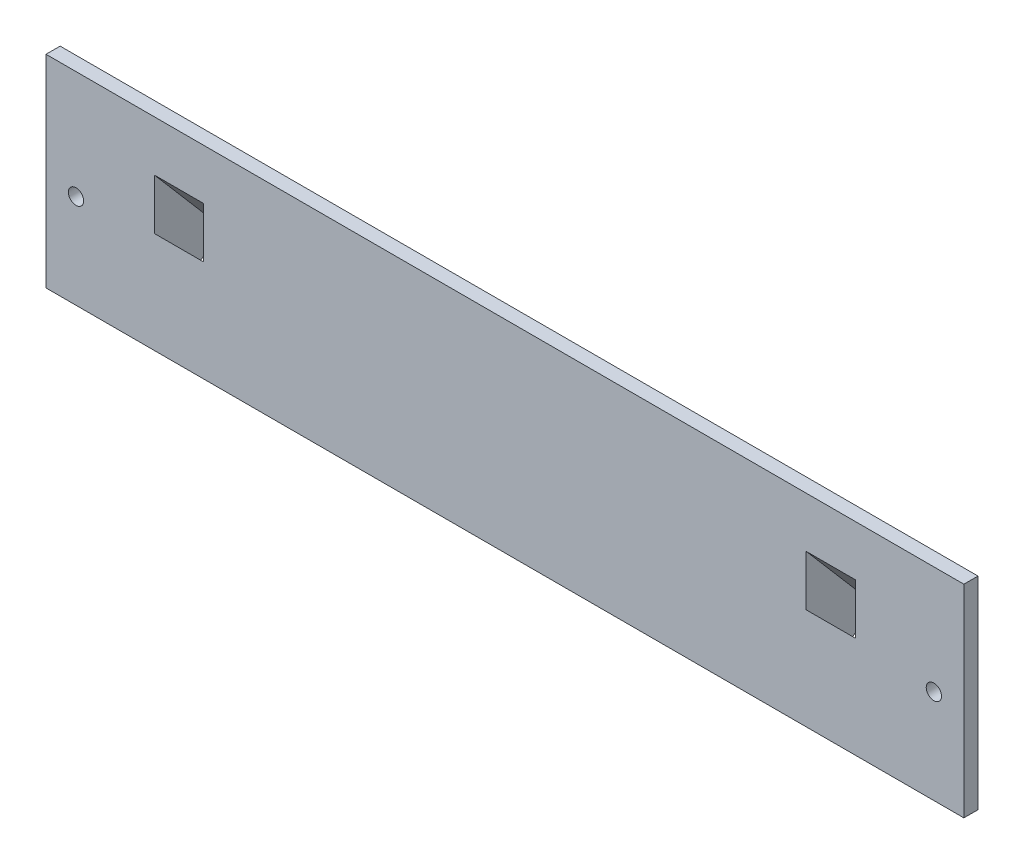
ISO-10303-21;
HEADER;
FILE_DESCRIPTION(('STEP AP214'),'2;1');
FILE_NAME('part.step','',(''),(''),'','','');
FILE_SCHEMA(('AUTOMOTIVE_DESIGN { 1 0 10303 214 1 1 1 1 }'));
ENDSEC;
DATA;
#1=APPLICATION_CONTEXT('core data for automotive mechanical design processes');
#2=APPLICATION_PROTOCOL_DEFINITION('international standard','automotive_design',2000,#1);
#3=PRODUCT_CONTEXT('',#1,'mechanical');
#4=PRODUCT('Part','Part','',(#3));
#5=PRODUCT_RELATED_PRODUCT_CATEGORY('part','',(#4));
#6=PRODUCT_DEFINITION_FORMATION('','',#4);
#7=PRODUCT_DEFINITION_CONTEXT('part definition',#1,'design');
#8=PRODUCT_DEFINITION('design','',#6,#7);
#9=PRODUCT_DEFINITION_SHAPE('','',#8);
#10=(LENGTH_UNIT() NAMED_UNIT(*) SI_UNIT(.MILLI.,.METRE.));
#11=(NAMED_UNIT(*) PLANE_ANGLE_UNIT() SI_UNIT($,.RADIAN.));
#12=(NAMED_UNIT(*) SI_UNIT($,.STERADIAN.) SOLID_ANGLE_UNIT());
#13=UNCERTAINTY_MEASURE_WITH_UNIT(LENGTH_MEASURE(1.E-05),#10,'distance_accuracy_value','');
#14=(GEOMETRIC_REPRESENTATION_CONTEXT(3) GLOBAL_UNCERTAINTY_ASSIGNED_CONTEXT((#13)) GLOBAL_UNIT_ASSIGNED_CONTEXT((#10,
#11,#12)) REPRESENTATION_CONTEXT('',''));
#15=CARTESIAN_POINT('',(0.,0.,0.));
#16=DIRECTION('',(0.,0.,1.));
#17=DIRECTION('',(1.,0.,0.));
#18=AXIS2_PLACEMENT_3D('',#15,#16,#17);
#19=CARTESIAN_POINT('',(0.,0.,0.));
#20=DIRECTION('',(0.,0.,1.));
#21=DIRECTION('',(1.,0.,0.));
#22=AXIS2_PLACEMENT_3D('',#19,#20,#21);
#23=PLANE('',#22);
#24=DIRECTION('',(-1.,0.,0.));
#25=VECTOR('',#24,1.);
#26=CARTESIAN_POINT('',(-61.,0.738403156956422,0.));
#27=LINE('',#26,#25);
#28=CARTESIAN_POINT('',(-61.,0.738403156956422,0.));
#29=VERTEX_POINT('',#28);
#30=CARTESIAN_POINT('',(-77.5,0.738403156956422,0.));
#31=VERTEX_POINT('',#30);
#32=EDGE_CURVE('E263',#29,#31,#27,.T.);
#33=ORIENTED_EDGE('',*,*,#32,.F.);
#34=DIRECTION('',(0.,1.,0.));
#35=VECTOR('',#34,1.);
#36=CARTESIAN_POINT('',(-61.,31.4710281893794,0.));
#37=LINE('',#36,#35);
#38=CARTESIAN_POINT('',(-61.,31.4710281893794,0.));
#39=VERTEX_POINT('',#38);
#40=EDGE_CURVE('E240',#29,#39,#37,.T.);
#41=ORIENTED_EDGE('',*,*,#40,.T.);
#42=DIRECTION('',(-1.,0.,0.));
#43=VECTOR('',#42,1.);
#44=CARTESIAN_POINT('',(-61.,31.4710281893794,0.));
#45=LINE('',#44,#43);
#46=CARTESIAN_POINT('',(-77.5,31.4710281893794,0.));
#47=VERTEX_POINT('',#46);
#48=EDGE_CURVE('E252',#39,#47,#45,.T.);
#49=ORIENTED_EDGE('',*,*,#48,.T.);
#50=DIRECTION('',(0.,1.,0.));
#51=VECTOR('',#50,1.);
#52=CARTESIAN_POINT('',(-77.5,31.4710281893794,0.));
#53=LINE('',#52,#51);
#54=EDGE_CURVE('E239',#31,#47,#53,.T.);
#55=ORIENTED_EDGE('',*,*,#54,.F.);
#56=EDGE_LOOP('',(#33,#41,#49,#55));
#57=FACE_BOUND('',#56,.T.);
#58=CARTESIAN_POINT('',(-91.125,15.,0.));
#59=DIRECTION('',(0.,0.,1.));
#60=DIRECTION('',(-1.,0.,0.));
#61=AXIS2_PLACEMENT_3D('',#58,#59,#60);
#62=CIRCLE('',#61,1.625);
#63=CARTESIAN_POINT('',(-92.75,15.,0.));
#64=VERTEX_POINT('',#63);
#65=EDGE_CURVE('E339',#64,#64,#62,.T.);
#66=ORIENTED_EDGE('',*,*,#65,.T.);
#67=EDGE_LOOP('',(#66));
#68=FACE_BOUND('',#67,.T.);
#69=CARTESIAN_POINT('',(91.125,15.,0.));
#70=DIRECTION('',(0.,0.,1.));
#71=DIRECTION('',(1.,0.,0.));
#72=AXIS2_PLACEMENT_3D('',#69,#70,#71);
#73=CIRCLE('',#72,1.625);
#74=CARTESIAN_POINT('',(92.75,15.,0.));
#75=VERTEX_POINT('',#74);
#76=EDGE_CURVE('E350',#75,#75,#73,.T.);
#77=ORIENTED_EDGE('',*,*,#76,.T.);
#78=EDGE_LOOP('',(#77));
#79=FACE_BOUND('',#78,.T.);
#80=DIRECTION('',(0.,1.,0.));
#81=VECTOR('',#80,1.);
#82=CARTESIAN_POINT('',(97.5,0.,0.));
#83=LINE('',#82,#81);
#84=CARTESIAN_POINT('',(97.5,-5.,0.));
#85=VERTEX_POINT('',#84);
#86=CARTESIAN_POINT('',(97.5,38.,0.));
#87=VERTEX_POINT('',#86);
#88=EDGE_CURVE('E185',#85,#87,#83,.T.);
#89=ORIENTED_EDGE('',*,*,#88,.F.);
#90=DIRECTION('',(1.,0.,0.));
#91=VECTOR('',#90,1.);
#92=CARTESIAN_POINT('',(-97.5,-5.,0.));
#93=LINE('',#92,#91);
#94=CARTESIAN_POINT('',(-97.5,-5.,0.));
#95=VERTEX_POINT('',#94);
#96=EDGE_CURVE('E182',#95,#85,#93,.T.);
#97=ORIENTED_EDGE('',*,*,#96,.F.);
#98=DIRECTION('',(0.,-1.,0.));
#99=VECTOR('',#98,1.);
#100=CARTESIAN_POINT('',(-97.5,0.,0.));
#101=LINE('',#100,#99);
#102=CARTESIAN_POINT('',(-97.5,38.,0.));
#103=VERTEX_POINT('',#102);
#104=EDGE_CURVE('E169',#103,#95,#101,.T.);
#105=ORIENTED_EDGE('',*,*,#104,.F.);
#106=DIRECTION('',(-1.,0.,0.));
#107=VECTOR('',#106,1.);
#108=CARTESIAN_POINT('',(97.5,38.,0.));
#109=LINE('',#108,#107);
#110=EDGE_CURVE('E179',#87,#103,#109,.T.);
#111=ORIENTED_EDGE('',*,*,#110,.F.);
#112=EDGE_LOOP('',(#89,#97,#105,#111));
#113=FACE_BOUND('',#112,.T.);
#114=DIRECTION('',(0.,1.,0.));
#115=VECTOR('',#114,1.);
#116=CARTESIAN_POINT('',(61.,0.,0.));
#117=LINE('',#116,#115);
#118=CARTESIAN_POINT('',(61.,0.738403156956422,0.));
#119=VERTEX_POINT('',#118);
#120=CARTESIAN_POINT('',(61.,31.4710281893794,0.));
#121=VERTEX_POINT('',#120);
#122=EDGE_CURVE('E322',#119,#121,#117,.T.);
#123=ORIENTED_EDGE('',*,*,#122,.F.);
#124=DIRECTION('',(1.,0.,0.));
#125=VECTOR('',#124,1.);
#126=CARTESIAN_POINT('',(61.,0.738403156956422,0.));
#127=LINE('',#126,#125);
#128=CARTESIAN_POINT('',(77.5,0.738403156956422,0.));
#129=VERTEX_POINT('',#128);
#130=EDGE_CURVE('E335',#119,#129,#127,.T.);
#131=ORIENTED_EDGE('',*,*,#130,.T.);
#132=DIRECTION('',(0.,1.,0.));
#133=VECTOR('',#132,1.);
#134=CARTESIAN_POINT('',(77.5,0.,0.));
#135=LINE('',#134,#133);
#136=CARTESIAN_POINT('',(77.5,31.4710281893794,0.));
#137=VERTEX_POINT('',#136);
#138=EDGE_CURVE('E318',#129,#137,#135,.T.);
#139=ORIENTED_EDGE('',*,*,#138,.T.);
#140=DIRECTION('',(1.,0.,0.));
#141=VECTOR('',#140,1.);
#142=CARTESIAN_POINT('',(61.,31.4710281893794,0.));
#143=LINE('',#142,#141);
#144=EDGE_CURVE('E340',#121,#137,#143,.T.);
#145=ORIENTED_EDGE('',*,*,#144,.F.);
#146=EDGE_LOOP('',(#123,#131,#139,#145));
#147=FACE_BOUND('',#146,.T.);
#148=ADVANCED_FACE('F41',(#57,#68,#79,#113,#147),#23,.F.);
#149=CARTESIAN_POINT('',(0.,0.,3.));
#150=DIRECTION('',(0.,0.,1.));
#151=DIRECTION('',(1.,0.,0.));
#152=AXIS2_PLACEMENT_3D('',#149,#150,#151);
#153=PLANE('',#152);
#154=DIRECTION('',(0.,1.,0.));
#155=VECTOR('',#154,1.);
#156=CARTESIAN_POINT('',(-64.,0.,3.));
#157=LINE('',#156,#155);
#158=CARTESIAN_POINT('',(-64.,16.5316132278557,3.));
#159=VERTEX_POINT('',#158);
#160=CARTESIAN_POINT('',(-64.,27.2880319892037,3.));
#161=VERTEX_POINT('',#160);
#162=EDGE_CURVE('E236',#159,#161,#157,.T.);
#163=ORIENTED_EDGE('',*,*,#162,.F.);
#164=DIRECTION('',(1.,0.,0.));
#165=VECTOR('',#164,1.);
#166=CARTESIAN_POINT('',(0.,16.5316132278557,3.));
#167=LINE('',#166,#165);
#168=CARTESIAN_POINT('',(-74.5,16.5316132278557,3.));
#169=VERTEX_POINT('',#168);
#170=EDGE_CURVE('E220',#169,#159,#167,.T.);
#171=ORIENTED_EDGE('',*,*,#170,.F.);
#172=DIRECTION('',(0.,-1.,0.));
#173=VECTOR('',#172,1.);
#174=CARTESIAN_POINT('',(-74.5,0.,3.));
#175=LINE('',#174,#173);
#176=CARTESIAN_POINT('',(-74.5,27.2880319892037,3.));
#177=VERTEX_POINT('',#176);
#178=EDGE_CURVE('E230',#177,#169,#175,.T.);
#179=ORIENTED_EDGE('',*,*,#178,.F.);
#180=DIRECTION('',(-1.,0.,0.));
#181=VECTOR('',#180,1.);
#182=CARTESIAN_POINT('',(0.,27.2880319892037,3.));
#183=LINE('',#182,#181);
#184=EDGE_CURVE('E233',#161,#177,#183,.T.);
#185=ORIENTED_EDGE('',*,*,#184,.F.);
#186=EDGE_LOOP('',(#163,#171,#179,#185));
#187=FACE_BOUND('',#186,.T.);
#188=DIRECTION('',(0.,-1.,0.));
#189=VECTOR('',#188,1.);
#190=CARTESIAN_POINT('',(64.,0.,3.));
#191=LINE('',#190,#189);
#192=CARTESIAN_POINT('',(64.,27.2880319892037,3.));
#193=VERTEX_POINT('',#192);
#194=CARTESIAN_POINT('',(64.,16.5316132278557,3.));
#195=VERTEX_POINT('',#194);
#196=EDGE_CURVE('E310',#193,#195,#191,.T.);
#197=ORIENTED_EDGE('',*,*,#196,.F.);
#198=DIRECTION('',(-1.,0.,0.));
#199=VECTOR('',#198,1.);
#200=CARTESIAN_POINT('',(0.,27.2880319892037,3.));
#201=LINE('',#200,#199);
#202=CARTESIAN_POINT('',(74.5,27.2880319892037,3.));
#203=VERTEX_POINT('',#202);
#204=EDGE_CURVE('E291',#203,#193,#201,.T.);
#205=ORIENTED_EDGE('',*,*,#204,.F.);
#206=DIRECTION('',(0.,1.,0.));
#207=VECTOR('',#206,1.);
#208=CARTESIAN_POINT('',(74.5,0.,3.));
#209=LINE('',#208,#207);
#210=CARTESIAN_POINT('',(74.5,16.5316132278557,3.));
#211=VERTEX_POINT('',#210);
#212=EDGE_CURVE('E303',#211,#203,#209,.T.);
#213=ORIENTED_EDGE('',*,*,#212,.F.);
#214=DIRECTION('',(1.,0.,0.));
#215=VECTOR('',#214,1.);
#216=CARTESIAN_POINT('',(0.,16.5316132278557,3.));
#217=LINE('',#216,#215);
#218=EDGE_CURVE('E307',#195,#211,#217,.T.);
#219=ORIENTED_EDGE('',*,*,#218,.F.);
#220=EDGE_LOOP('',(#197,#205,#213,#219));
#221=FACE_BOUND('',#220,.T.);
#222=CARTESIAN_POINT('',(91.125,15.,3.));
#223=DIRECTION('',(0.,0.,1.));
#224=DIRECTION('',(1.,0.,0.));
#225=AXIS2_PLACEMENT_3D('',#222,#223,#224);
#226=CIRCLE('',#225,1.625);
#227=CARTESIAN_POINT('',(92.75,15.,3.));
#228=VERTEX_POINT('',#227);
#229=EDGE_CURVE('E354',#228,#228,#226,.T.);
#230=ORIENTED_EDGE('',*,*,#229,.F.);
#231=EDGE_LOOP('',(#230));
#232=FACE_BOUND('',#231,.T.);
#233=DIRECTION('',(0.,1.,0.));
#234=VECTOR('',#233,1.);
#235=CARTESIAN_POINT('',(97.5,0.,3.));
#236=LINE('',#235,#234);
#237=CARTESIAN_POINT('',(97.5,-5.,3.));
#238=VERTEX_POINT('',#237);
#239=CARTESIAN_POINT('',(97.5,38.,3.));
#240=VERTEX_POINT('',#239);
#241=EDGE_CURVE('E178',#238,#240,#236,.T.);
#242=ORIENTED_EDGE('',*,*,#241,.T.);
#243=DIRECTION('',(-1.,0.,0.));
#244=VECTOR('',#243,1.);
#245=CARTESIAN_POINT('',(97.5,38.,3.));
#246=LINE('',#245,#244);
#247=CARTESIAN_POINT('',(-97.5,38.,3.));
#248=VERTEX_POINT('',#247);
#249=EDGE_CURVE('E364',#240,#248,#246,.T.);
#250=ORIENTED_EDGE('',*,*,#249,.T.);
#251=DIRECTION('',(0.,-1.,0.));
#252=VECTOR('',#251,1.);
#253=CARTESIAN_POINT('',(-97.5,0.,3.));
#254=LINE('',#253,#252);
#255=CARTESIAN_POINT('',(-97.5,-5.,3.));
#256=VERTEX_POINT('',#255);
#257=EDGE_CURVE('E367',#248,#256,#254,.T.);
#258=ORIENTED_EDGE('',*,*,#257,.T.);
#259=DIRECTION('',(-1.,0.,0.));
#260=VECTOR('',#259,1.);
#261=CARTESIAN_POINT('',(-97.5,-5.,3.));
#262=LINE('',#261,#260);
#263=EDGE_CURVE('E195',#238,#256,#262,.T.);
#264=ORIENTED_EDGE('',*,*,#263,.F.);
#265=EDGE_LOOP('',(#242,#250,#258,#264));
#266=FACE_BOUND('',#265,.T.);
#267=CARTESIAN_POINT('',(-91.125,15.,3.));
#268=DIRECTION('',(0.,0.,1.));
#269=DIRECTION('',(-1.,0.,0.));
#270=AXIS2_PLACEMENT_3D('',#267,#268,#269);
#271=CIRCLE('',#270,1.625);
#272=CARTESIAN_POINT('',(-92.75,15.,3.));
#273=VERTEX_POINT('',#272);
#274=EDGE_CURVE('E346',#273,#273,#271,.T.);
#275=ORIENTED_EDGE('',*,*,#274,.F.);
#276=EDGE_LOOP('',(#275));
#277=FACE_BOUND('',#276,.T.);
#278=ADVANCED_FACE('F379',(#187,#221,#232,#266,#277),#153,.T.);
#279=CARTESIAN_POINT('',(97.5,0.,3.));
#280=DIRECTION('',(-1.,0.,0.));
#281=DIRECTION('',(0.,0.,1.));
#282=AXIS2_PLACEMENT_3D('',#279,#280,#281);
#283=PLANE('',#282);
#284=ORIENTED_EDGE('',*,*,#88,.T.);
#285=DIRECTION('',(0.,0.,-1.));
#286=VECTOR('',#285,1.);
#287=CARTESIAN_POINT('',(97.5,38.,3.));
#288=LINE('',#287,#286);
#289=EDGE_CURVE('E11',#240,#87,#288,.T.);
#290=ORIENTED_EDGE('',*,*,#289,.F.);
#291=ORIENTED_EDGE('',*,*,#241,.F.);
#292=DIRECTION('',(0.,0.,1.));
#293=VECTOR('',#292,1.);
#294=CARTESIAN_POINT('',(97.5,-5.,3.));
#295=LINE('',#294,#293);
#296=EDGE_CURVE('E190',#85,#238,#295,.T.);
#297=ORIENTED_EDGE('',*,*,#296,.F.);
#298=EDGE_LOOP('',(#284,#290,#291,#297));
#299=FACE_BOUND('',#298,.T.);
#300=ADVANCED_FACE('F43',(#299),#283,.F.);
#301=CARTESIAN_POINT('',(97.5,38.,3.));
#302=DIRECTION('',(0.,-1.,0.));
#303=DIRECTION('',(0.,0.,-1.));
#304=AXIS2_PLACEMENT_3D('',#301,#302,#303);
#305=PLANE('',#304);
#306=ORIENTED_EDGE('',*,*,#110,.T.);
#307=DIRECTION('',(0.,0.,-1.));
#308=VECTOR('',#307,1.);
#309=CARTESIAN_POINT('',(-97.5,38.,3.));
#310=LINE('',#309,#308);
#311=EDGE_CURVE('E50',#248,#103,#310,.T.);
#312=ORIENTED_EDGE('',*,*,#311,.F.);
#313=ORIENTED_EDGE('',*,*,#249,.F.);
#314=ORIENTED_EDGE('',*,*,#289,.T.);
#315=EDGE_LOOP('',(#306,#312,#313,#314));
#316=FACE_BOUND('',#315,.T.);
#317=ADVANCED_FACE('F375',(#316),#305,.F.);
#318=CARTESIAN_POINT('',(-97.5,0.,3.));
#319=DIRECTION('',(1.,0.,0.));
#320=DIRECTION('',(0.,0.,-1.));
#321=AXIS2_PLACEMENT_3D('',#318,#319,#320);
#322=PLANE('',#321);
#323=ORIENTED_EDGE('',*,*,#104,.T.);
#324=DIRECTION('',(0.,0.,-1.));
#325=VECTOR('',#324,1.);
#326=CARTESIAN_POINT('',(-97.5,-5.,3.));
#327=LINE('',#326,#325);
#328=EDGE_CURVE('E174',#256,#95,#327,.T.);
#329=ORIENTED_EDGE('',*,*,#328,.F.);
#330=ORIENTED_EDGE('',*,*,#257,.F.);
#331=ORIENTED_EDGE('',*,*,#311,.T.);
#332=EDGE_LOOP('',(#323,#329,#330,#331));
#333=FACE_BOUND('',#332,.T.);
#334=ADVANCED_FACE('F171',(#333),#322,.F.);
#335=CARTESIAN_POINT('',(91.125,15.,3.));
#336=DIRECTION('',(0.,0.,-1.));
#337=DIRECTION('',(-1.,0.,0.));
#338=AXIS2_PLACEMENT_3D('',#335,#336,#337);
#339=CYLINDRICAL_SURFACE('',#338,1.625);
#340=ORIENTED_EDGE('',*,*,#229,.T.);
#341=EDGE_LOOP('',(#340));
#342=FACE_BOUND('',#341,.T.);
#343=ORIENTED_EDGE('',*,*,#76,.F.);
#344=EDGE_LOOP('',(#343));
#345=FACE_BOUND('',#344,.T.);
#346=ADVANCED_FACE('F390',(#342,#345),#339,.F.);
#347=CARTESIAN_POINT('',(-91.125,15.,3.));
#348=DIRECTION('',(0.,0.,-1.));
#349=DIRECTION('',(-1.,0.,0.));
#350=AXIS2_PLACEMENT_3D('',#347,#348,#349);
#351=CYLINDRICAL_SURFACE('',#350,1.625);
#352=ORIENTED_EDGE('',*,*,#274,.T.);
#353=EDGE_LOOP('',(#352));
#354=FACE_BOUND('',#353,.T.);
#355=ORIENTED_EDGE('',*,*,#65,.F.);
#356=EDGE_LOOP('',(#355));
#357=FACE_BOUND('',#356,.T.);
#358=ADVANCED_FACE('F386',(#354,#357),#351,.F.);
#359=CARTESIAN_POINT('',(61.,0.425684190719085,0.364855478327035));
#360=DIRECTION('',(0.,0.75927130733488,0.650774217265852));
#361=DIRECTION('',(0.,-0.650774217265852,0.75927130733488));
#362=AXIS2_PLACEMENT_3D('',#359,#360,#361);
#363=PLANE('',#362);
#364=DIRECTION('',(1.,0.,0.));
#365=VECTOR('',#364,1.);
#366=CARTESIAN_POINT('',(64.,10.5000164159442,-11.3890696100232));
#367=LINE('',#366,#365);
#368=CARTESIAN_POINT('',(64.,10.5000164159442,-11.3890696100232));
#369=VERTEX_POINT('',#368);
#370=CARTESIAN_POINT('',(74.5,10.5000164159442,-11.3890696100232));
#371=VERTEX_POINT('',#370);
#372=EDGE_CURVE('E275',#369,#371,#367,.T.);
#373=ORIENTED_EDGE('',*,*,#372,.F.);
#374=DIRECTION('',(0.,0.650774217265852,-0.75927130733488));
#375=VECTOR('',#374,1.);
#376=CARTESIAN_POINT('',(64.,5.94459689508324,-6.07417045867904));
#377=LINE('',#376,#375);
#378=CARTESIAN_POINT('',(64.,5.94459689508324,-6.07417045867904));
#379=VERTEX_POINT('',#378);
#380=EDGE_CURVE('E267',#379,#369,#377,.T.);
#381=ORIENTED_EDGE('',*,*,#380,.F.);
#382=DIRECTION('',(-1.,0.,0.));
#383=VECTOR('',#382,1.);
#384=CARTESIAN_POINT('',(64.,5.94459689508324,-6.07417045867904));
#385=LINE('',#384,#383);
#386=CARTESIAN_POINT('',(74.5,5.94459689508324,-6.07417045867904));
#387=VERTEX_POINT('',#386);
#388=EDGE_CURVE('E283',#387,#379,#385,.T.);
#389=ORIENTED_EDGE('',*,*,#388,.F.);
#390=DIRECTION('',(0.,-0.650774217265852,0.75927130733488));
#391=VECTOR('',#390,1.);
#392=CARTESIAN_POINT('',(74.5,5.94459689508324,-6.07417045867904));
#393=LINE('',#392,#391);
#394=EDGE_CURVE('E279',#371,#387,#393,.T.);
#395=ORIENTED_EDGE('',*,*,#394,.F.);
#396=EDGE_LOOP('',(#373,#381,#389,#395));
#397=FACE_BOUND('',#396,.T.);
#398=DIRECTION('',(0.,-0.650774217265852,0.75927130733488));
#399=VECTOR('',#398,1.);
#400=CARTESIAN_POINT('',(77.5,0.425684190719085,0.364855478327035));
#401=LINE('',#400,#399);
#402=CARTESIAN_POINT('',(77.5,13.7538875022735,-15.1854261466976));
#403=VERTEX_POINT('',#402);
#404=EDGE_CURVE('E313',#403,#129,#401,.T.);
#405=ORIENTED_EDGE('',*,*,#404,.T.);
#406=ORIENTED_EDGE('',*,*,#130,.F.);
#407=DIRECTION('',(0.,-0.650774217265852,0.75927130733488));
#408=VECTOR('',#407,1.);
#409=CARTESIAN_POINT('',(61.,0.425684190719085,0.364855478327035));
#410=LINE('',#409,#408);
#411=CARTESIAN_POINT('',(61.,13.7538875022735,-15.1854261466976));
#412=VERTEX_POINT('',#411);
#413=EDGE_CURVE('E314',#412,#119,#410,.T.);
#414=ORIENTED_EDGE('',*,*,#413,.F.);
#415=DIRECTION('',(1.,0.,0.));
#416=VECTOR('',#415,1.);
#417=CARTESIAN_POINT('',(61.,13.7538875022735,-15.1854261466976));
#418=LINE('',#417,#416);
#419=EDGE_CURVE('E325',#412,#403,#418,.T.);
#420=ORIENTED_EDGE('',*,*,#419,.T.);
#421=EDGE_LOOP('',(#405,#406,#414,#420));
#422=FACE_BOUND('',#421,.T.);
#423=ADVANCED_FACE('F389',(#397,#422),#363,.F.);
#424=CARTESIAN_POINT('',(61.,13.3282033115544,-15.5502816250246));
#425=DIRECTION('',(0.,0.650774217265852,-0.75927130733488));
#426=DIRECTION('',(0.,0.75927130733488,0.650774217265852));
#427=AXIS2_PLACEMENT_3D('',#424,#425,#426);
#428=PLANE('',#427);
#429=DIRECTION('',(0.,0.75927130733488,0.650774217265852));
#430=VECTOR('',#429,1.);
#431=CARTESIAN_POINT('',(77.5,13.3282033115544,-15.5502816250246));
#432=LINE('',#431,#430);
#433=EDGE_CURVE('E329',#403,#137,#432,.T.);
#434=ORIENTED_EDGE('',*,*,#433,.F.);
#435=ORIENTED_EDGE('',*,*,#419,.F.);
#436=DIRECTION('',(0.,0.75927130733488,0.650774217265852));
#437=VECTOR('',#436,1.);
#438=CARTESIAN_POINT('',(61.,13.3282033115544,-15.5502816250246));
#439=LINE('',#438,#437);
#440=EDGE_CURVE('E317',#412,#121,#439,.T.);
#441=ORIENTED_EDGE('',*,*,#440,.T.);
#442=ORIENTED_EDGE('',*,*,#144,.T.);
#443=EDGE_LOOP('',(#434,#435,#441,#442));
#444=FACE_BOUND('',#443,.T.);
#445=ADVANCED_FACE('F592',(#444),#428,.T.);
#446=CARTESIAN_POINT('',(61.,0.,0.));
#447=DIRECTION('',(1.,0.,0.));
#448=DIRECTION('',(0.,0.,-1.));
#449=AXIS2_PLACEMENT_3D('',#446,#447,#448);
#450=PLANE('',#449);
#451=ORIENTED_EDGE('',*,*,#413,.T.);
#452=ORIENTED_EDGE('',*,*,#122,.T.);
#453=ORIENTED_EDGE('',*,*,#440,.F.);
#454=EDGE_LOOP('',(#451,#452,#453));
#455=FACE_BOUND('',#454,.T.);
#456=ADVANCED_FACE('F583',(#455),#450,.F.);
#457=CARTESIAN_POINT('',(77.5,0.,0.));
#458=DIRECTION('',(1.,0.,0.));
#459=DIRECTION('',(0.,0.,-1.));
#460=AXIS2_PLACEMENT_3D('',#457,#458,#459);
#461=PLANE('',#460);
#462=ORIENTED_EDGE('',*,*,#404,.F.);
#463=ORIENTED_EDGE('',*,*,#433,.T.);
#464=ORIENTED_EDGE('',*,*,#138,.F.);
#465=EDGE_LOOP('',(#462,#463,#464));
#466=FACE_BOUND('',#465,.T.);
#467=ADVANCED_FACE('F573',(#466),#461,.T.);
#468=CARTESIAN_POINT('',(64.,28.9079861659306,13.6078345560524));
#469=DIRECTION('',(-1.,0.,0.));
#470=DIRECTION('',(0.,0.,1.));
#471=AXIS2_PLACEMENT_3D('',#468,#469,#470);
#472=PLANE('',#471);
#473=ORIENTED_EDGE('',*,*,#196,.T.);
#474=DIRECTION('',(0.,-0.75927130733488,-0.650774217265852));
#475=VECTOR('',#474,1.);
#476=CARTESIAN_POINT('',(64.,28.9079861659306,13.6078345560524));
#477=LINE('',#476,#475);
#478=EDGE_CURVE('E288',#195,#379,#477,.T.);
#479=ORIENTED_EDGE('',*,*,#478,.T.);
#480=ORIENTED_EDGE('',*,*,#380,.T.);
#481=DIRECTION('',(0.,-0.75927130733488,-0.650774217265852));
#482=VECTOR('',#481,1.);
#483=CARTESIAN_POINT('',(64.,33.4634056867916,8.29293540470822));
#484=LINE('',#483,#482);
#485=EDGE_CURVE('E287',#193,#369,#484,.T.);
#486=ORIENTED_EDGE('',*,*,#485,.F.);
#487=EDGE_LOOP('',(#473,#479,#480,#486));
#488=FACE_BOUND('',#487,.T.);
#489=ADVANCED_FACE('F564',(#488),#472,.F.);
#490=CARTESIAN_POINT('',(64.,28.9079861659306,13.6078345560524));
#491=DIRECTION('',(0.,-0.650774217265852,0.75927130733488));
#492=DIRECTION('',(0.,-0.75927130733488,-0.650774217265852));
#493=AXIS2_PLACEMENT_3D('',#490,#491,#492);
#494=PLANE('',#493);
#495=ORIENTED_EDGE('',*,*,#218,.T.);
#496=DIRECTION('',(0.,-0.75927130733488,-0.650774217265852));
#497=VECTOR('',#496,1.);
#498=CARTESIAN_POINT('',(74.5,28.9079861659306,13.6078345560524));
#499=LINE('',#498,#497);
#500=EDGE_CURVE('E292',#211,#387,#499,.T.);
#501=ORIENTED_EDGE('',*,*,#500,.T.);
#502=ORIENTED_EDGE('',*,*,#388,.T.);
#503=ORIENTED_EDGE('',*,*,#478,.F.);
#504=EDGE_LOOP('',(#495,#501,#502,#503));
#505=FACE_BOUND('',#504,.T.);
#506=ADVANCED_FACE('F555',(#505),#494,.F.);
#507=CARTESIAN_POINT('',(74.5,28.9079861659306,13.6078345560524));
#508=DIRECTION('',(1.,0.,0.));
#509=DIRECTION('',(0.,0.,-1.));
#510=AXIS2_PLACEMENT_3D('',#507,#508,#509);
#511=PLANE('',#510);
#512=ORIENTED_EDGE('',*,*,#212,.T.);
#513=DIRECTION('',(0.,-0.75927130733488,-0.650774217265852));
#514=VECTOR('',#513,1.);
#515=CARTESIAN_POINT('',(74.5,33.4634056867916,8.29293540470822));
#516=LINE('',#515,#514);
#517=EDGE_CURVE('E295',#203,#371,#516,.T.);
#518=ORIENTED_EDGE('',*,*,#517,.T.);
#519=ORIENTED_EDGE('',*,*,#394,.T.);
#520=ORIENTED_EDGE('',*,*,#500,.F.);
#521=EDGE_LOOP('',(#512,#518,#519,#520));
#522=FACE_BOUND('',#521,.T.);
#523=ADVANCED_FACE('F546',(#522),#511,.F.);
#524=CARTESIAN_POINT('',(64.,33.4634056867916,8.29293540470822));
#525=DIRECTION('',(0.,0.650774217265852,-0.75927130733488));
#526=DIRECTION('',(0.,0.75927130733488,0.650774217265852));
#527=AXIS2_PLACEMENT_3D('',#524,#525,#526);
#528=PLANE('',#527);
#529=ORIENTED_EDGE('',*,*,#204,.T.);
#530=ORIENTED_EDGE('',*,*,#485,.T.);
#531=ORIENTED_EDGE('',*,*,#372,.T.);
#532=ORIENTED_EDGE('',*,*,#517,.F.);
#533=EDGE_LOOP('',(#529,#530,#531,#532));
#534=FACE_BOUND('',#533,.T.);
#535=ADVANCED_FACE('F538',(#534),#528,.F.);
#536=CARTESIAN_POINT('',(-61.,0.738403156956422,0.));
#537=DIRECTION('',(0.,-0.75927130733488,-0.650774217265852));
#538=DIRECTION('',(0.,0.650774217265852,-0.75927130733488));
#539=AXIS2_PLACEMENT_3D('',#536,#537,#538);
#540=PLANE('',#539);
#541=DIRECTION('',(0.,-0.650774217265852,0.75927130733488));
#542=VECTOR('',#541,1.);
#543=CARTESIAN_POINT('',(-64.,10.5000164159442,-11.3890696100232));
#544=LINE('',#543,#542);
#545=CARTESIAN_POINT('',(-64.,10.5000164159442,-11.3890696100232));
#546=VERTEX_POINT('',#545);
#547=CARTESIAN_POINT('',(-64.,5.94459689508324,-6.07417045867904));
#548=VERTEX_POINT('',#547);
#549=EDGE_CURVE('E65',#546,#548,#544,.T.);
#550=ORIENTED_EDGE('',*,*,#549,.F.);
#551=DIRECTION('',(1.,0.,0.));
#552=VECTOR('',#551,1.);
#553=CARTESIAN_POINT('',(-64.,10.5000164159442,-11.3890696100232));
#554=LINE('',#553,#552);
#555=CARTESIAN_POINT('',(-74.5,10.5000164159442,-11.3890696100232));
#556=VERTEX_POINT('',#555);
#557=EDGE_CURVE('E212',#556,#546,#554,.T.);
#558=ORIENTED_EDGE('',*,*,#557,.F.);
#559=DIRECTION('',(0.,0.650774217265852,-0.75927130733488));
#560=VECTOR('',#559,1.);
#561=CARTESIAN_POINT('',(-74.5,10.5000164159442,-11.3890696100232));
#562=LINE('',#561,#560);
#563=CARTESIAN_POINT('',(-74.5,5.94459689508325,-6.07417045867904));
#564=VERTEX_POINT('',#563);
#565=EDGE_CURVE('E208',#564,#556,#562,.T.);
#566=ORIENTED_EDGE('',*,*,#565,.F.);
#567=DIRECTION('',(-1.,0.,0.));
#568=VECTOR('',#567,1.);
#569=CARTESIAN_POINT('',(-64.,5.94459689508324,-6.07417045867904));
#570=LINE('',#569,#568);
#571=EDGE_CURVE('E205',#548,#564,#570,.T.);
#572=ORIENTED_EDGE('',*,*,#571,.F.);
#573=EDGE_LOOP('',(#550,#558,#566,#572));
#574=FACE_BOUND('',#573,.T.);
#575=DIRECTION('',(0.,-0.650774217265852,0.75927130733488));
#576=VECTOR('',#575,1.);
#577=CARTESIAN_POINT('',(-77.5,0.738403156956422,0.));
#578=LINE('',#577,#576);
#579=CARTESIAN_POINT('',(-77.5,13.7538875022735,-15.1854261466976));
#580=VERTEX_POINT('',#579);
#581=EDGE_CURVE('E244',#580,#31,#578,.T.);
#582=ORIENTED_EDGE('',*,*,#581,.F.);
#583=DIRECTION('',(-1.,0.,0.));
#584=VECTOR('',#583,1.);
#585=CARTESIAN_POINT('',(-61.,13.7538875022735,-15.1854261466976));
#586=LINE('',#585,#584);
#587=CARTESIAN_POINT('',(-61.,13.7538875022735,-15.1854261466976));
#588=VERTEX_POINT('',#587);
#589=EDGE_CURVE('E268',#588,#580,#586,.T.);
#590=ORIENTED_EDGE('',*,*,#589,.F.);
#591=DIRECTION('',(0.,-0.650774217265852,0.75927130733488));
#592=VECTOR('',#591,1.);
#593=CARTESIAN_POINT('',(-61.,0.738403156956422,0.));
#594=LINE('',#593,#592);
#595=EDGE_CURVE('E248',#588,#29,#594,.T.);
#596=ORIENTED_EDGE('',*,*,#595,.T.);
#597=ORIENTED_EDGE('',*,*,#32,.T.);
#598=EDGE_LOOP('',(#582,#590,#596,#597));
#599=FACE_BOUND('',#598,.T.);
#600=ADVANCED_FACE('F529',(#574,#599),#540,.T.);
#601=CARTESIAN_POINT('',(-61.,13.7538875022735,-15.1854261466976));
#602=DIRECTION('',(0.,0.650774217265852,-0.75927130733488));
#603=DIRECTION('',(0.,0.75927130733488,0.650774217265852));
#604=AXIS2_PLACEMENT_3D('',#601,#602,#603);
#605=PLANE('',#604);
#606=DIRECTION('',(0.,-0.75927130733488,-0.650774217265852));
#607=VECTOR('',#606,1.);
#608=CARTESIAN_POINT('',(-77.5,13.7538875022735,-15.1854261466976));
#609=LINE('',#608,#607);
#610=EDGE_CURVE('E256',#47,#580,#609,.T.);
#611=ORIENTED_EDGE('',*,*,#610,.F.);
#612=ORIENTED_EDGE('',*,*,#48,.F.);
#613=DIRECTION('',(0.,-0.75927130733488,-0.650774217265852));
#614=VECTOR('',#613,1.);
#615=CARTESIAN_POINT('',(-61.,13.7538875022735,-15.1854261466976));
#616=LINE('',#615,#614);
#617=EDGE_CURVE('E243',#39,#588,#616,.T.);
#618=ORIENTED_EDGE('',*,*,#617,.T.);
#619=ORIENTED_EDGE('',*,*,#589,.T.);
#620=EDGE_LOOP('',(#611,#612,#618,#619));
#621=FACE_BOUND('',#620,.T.);
#622=ADVANCED_FACE('F520',(#621),#605,.T.);
#623=CARTESIAN_POINT('',(-61.,0.,0.));
#624=DIRECTION('',(1.,0.,0.));
#625=DIRECTION('',(0.,0.,-1.));
#626=AXIS2_PLACEMENT_3D('',#623,#624,#625);
#627=PLANE('',#626);
#628=ORIENTED_EDGE('',*,*,#40,.F.);
#629=ORIENTED_EDGE('',*,*,#595,.F.);
#630=ORIENTED_EDGE('',*,*,#617,.F.);
#631=EDGE_LOOP('',(#628,#629,#630));
#632=FACE_BOUND('',#631,.T.);
#633=ADVANCED_FACE('F511',(#632),#627,.T.);
#634=CARTESIAN_POINT('',(-77.5,0.,0.));
#635=DIRECTION('',(1.,0.,0.));
#636=DIRECTION('',(0.,0.,-1.));
#637=AXIS2_PLACEMENT_3D('',#634,#635,#636);
#638=PLANE('',#637);
#639=ORIENTED_EDGE('',*,*,#54,.T.);
#640=ORIENTED_EDGE('',*,*,#610,.T.);
#641=ORIENTED_EDGE('',*,*,#581,.T.);
#642=EDGE_LOOP('',(#639,#640,#641));
#643=FACE_BOUND('',#642,.T.);
#644=ADVANCED_FACE('F502',(#643),#638,.F.);
#645=CARTESIAN_POINT('',(-64.,33.4634056867916,8.29293540470822));
#646=DIRECTION('',(1.,0.,0.));
#647=DIRECTION('',(0.,0.,-1.));
#648=AXIS2_PLACEMENT_3D('',#645,#646,#647);
#649=PLANE('',#648);
#650=ORIENTED_EDGE('',*,*,#162,.T.);
#651=DIRECTION('',(0.,-0.75927130733488,-0.650774217265852));
#652=VECTOR('',#651,1.);
#653=CARTESIAN_POINT('',(-64.,33.4634056867916,8.29293540470822));
#654=LINE('',#653,#652);
#655=EDGE_CURVE('E217',#161,#546,#654,.T.);
#656=ORIENTED_EDGE('',*,*,#655,.T.);
#657=ORIENTED_EDGE('',*,*,#549,.T.);
#658=DIRECTION('',(0.,-0.75927130733488,-0.650774217265852));
#659=VECTOR('',#658,1.);
#660=CARTESIAN_POINT('',(-64.,28.9079861659306,13.6078345560524));
#661=LINE('',#660,#659);
#662=EDGE_CURVE('E216',#159,#548,#661,.T.);
#663=ORIENTED_EDGE('',*,*,#662,.F.);
#664=EDGE_LOOP('',(#650,#656,#657,#663));
#665=FACE_BOUND('',#664,.T.);
#666=ADVANCED_FACE('F493',(#665),#649,.F.);
#667=CARTESIAN_POINT('',(-64.,33.4634056867916,8.29293540470822));
#668=DIRECTION('',(0.,0.650774217265852,-0.75927130733488));
#669=DIRECTION('',(0.,0.75927130733488,0.650774217265852));
#670=AXIS2_PLACEMENT_3D('',#667,#668,#669);
#671=PLANE('',#670);
#672=ORIENTED_EDGE('',*,*,#184,.T.);
#673=DIRECTION('',(0.,-0.75927130733488,-0.650774217265852));
#674=VECTOR('',#673,1.);
#675=CARTESIAN_POINT('',(-74.5,33.4634056867916,8.29293540470822));
#676=LINE('',#675,#674);
#677=EDGE_CURVE('E221',#177,#556,#676,.T.);
#678=ORIENTED_EDGE('',*,*,#677,.T.);
#679=ORIENTED_EDGE('',*,*,#557,.T.);
#680=ORIENTED_EDGE('',*,*,#655,.F.);
#681=EDGE_LOOP('',(#672,#678,#679,#680));
#682=FACE_BOUND('',#681,.T.);
#683=ADVANCED_FACE('F484',(#682),#671,.F.);
#684=CARTESIAN_POINT('',(-74.5,33.4634056867916,8.29293540470822));
#685=DIRECTION('',(-1.,0.,0.));
#686=DIRECTION('',(0.,0.,1.));
#687=AXIS2_PLACEMENT_3D('',#684,#685,#686);
#688=PLANE('',#687);
#689=ORIENTED_EDGE('',*,*,#178,.T.);
#690=DIRECTION('',(0.,-0.75927130733488,-0.650774217265852));
#691=VECTOR('',#690,1.);
#692=CARTESIAN_POINT('',(-74.5,28.9079861659306,13.6078345560524));
#693=LINE('',#692,#691);
#694=EDGE_CURVE('E57',#169,#564,#693,.T.);
#695=ORIENTED_EDGE('',*,*,#694,.T.);
#696=ORIENTED_EDGE('',*,*,#565,.T.);
#697=ORIENTED_EDGE('',*,*,#677,.F.);
#698=EDGE_LOOP('',(#689,#695,#696,#697));
#699=FACE_BOUND('',#698,.T.);
#700=ADVANCED_FACE('F476',(#699),#688,.F.);
#701=CARTESIAN_POINT('',(-64.,28.9079861659306,13.6078345560524));
#702=DIRECTION('',(0.,-0.650774217265852,0.75927130733488));
#703=DIRECTION('',(0.,-0.75927130733488,-0.650774217265852));
#704=AXIS2_PLACEMENT_3D('',#701,#702,#703);
#705=PLANE('',#704);
#706=ORIENTED_EDGE('',*,*,#170,.T.);
#707=ORIENTED_EDGE('',*,*,#662,.T.);
#708=ORIENTED_EDGE('',*,*,#571,.T.);
#709=ORIENTED_EDGE('',*,*,#694,.F.);
#710=EDGE_LOOP('',(#706,#707,#708,#709));
#711=FACE_BOUND('',#710,.T.);
#712=ADVANCED_FACE('F433',(#711),#705,.F.);
#713=CARTESIAN_POINT('',(0.,-5.,0.));
#714=DIRECTION('',(0.,-1.,0.));
#715=DIRECTION('',(0.,0.,-1.));
#716=AXIS2_PLACEMENT_3D('',#713,#714,#715);
#717=PLANE('',#716);
#718=ORIENTED_EDGE('',*,*,#328,.T.);
#719=ORIENTED_EDGE('',*,*,#96,.T.);
#720=ORIENTED_EDGE('',*,*,#296,.T.);
#721=ORIENTED_EDGE('',*,*,#263,.T.);
#722=EDGE_LOOP('',(#718,#719,#720,#721));
#723=FACE_BOUND('',#722,.T.);
#724=ADVANCED_FACE('F193',(#723),#717,.T.);
#725=CLOSED_SHELL('',(#148,#278,#300,#317,#334,#346,#358,#423,#445,#456,#467,#489,#506,#523,
#535,#600,#622,#633,#644,#666,#683,#700,#712,#724));
#726=MANIFOLD_SOLID_BREP('B2',#725);
#727=ADVANCED_BREP_SHAPE_REPRESENTATION('',(#18,#726),#14);
#728=SHAPE_DEFINITION_REPRESENTATION(#9,#727);
ENDSEC;
END-ISO-10303-21;
